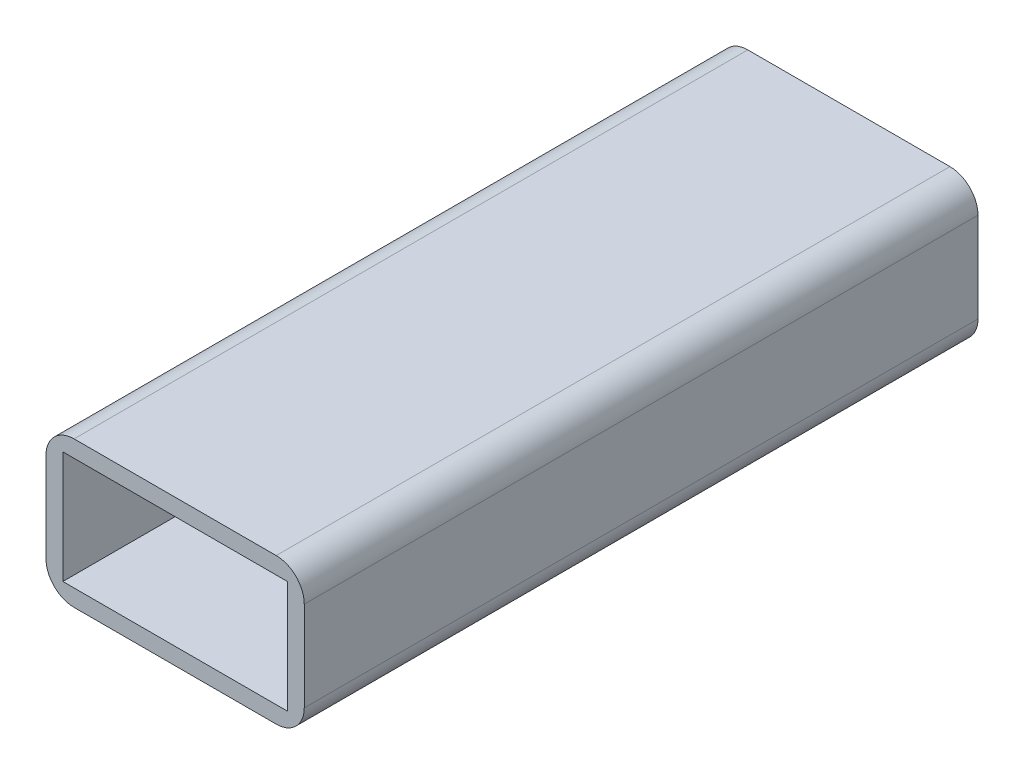
ISO-10303-21;
HEADER;
FILE_DESCRIPTION(('STEP AP214'),'2;1');
FILE_NAME('part.step','',(''),(''),'','','');
FILE_SCHEMA(('AUTOMOTIVE_DESIGN { 1 0 10303 214 1 1 1 1 }'));
ENDSEC;
DATA;
#1=APPLICATION_CONTEXT('core data for automotive mechanical design processes');
#2=APPLICATION_PROTOCOL_DEFINITION('international standard','automotive_design',2000,#1);
#3=PRODUCT_CONTEXT('',#1,'mechanical');
#4=PRODUCT('Part','Part','',(#3));
#5=PRODUCT_RELATED_PRODUCT_CATEGORY('part','',(#4));
#6=PRODUCT_DEFINITION_FORMATION('','',#4);
#7=PRODUCT_DEFINITION_CONTEXT('part definition',#1,'design');
#8=PRODUCT_DEFINITION('design','',#6,#7);
#9=PRODUCT_DEFINITION_SHAPE('','',#8);
#10=(LENGTH_UNIT() NAMED_UNIT(*) SI_UNIT(.MILLI.,.METRE.));
#11=(NAMED_UNIT(*) PLANE_ANGLE_UNIT() SI_UNIT($,.RADIAN.));
#12=(NAMED_UNIT(*) SI_UNIT($,.STERADIAN.) SOLID_ANGLE_UNIT());
#13=UNCERTAINTY_MEASURE_WITH_UNIT(LENGTH_MEASURE(1.E-05),#10,'distance_accuracy_value','');
#14=(GEOMETRIC_REPRESENTATION_CONTEXT(3) GLOBAL_UNCERTAINTY_ASSIGNED_CONTEXT((#13)) GLOBAL_UNIT_ASSIGNED_CONTEXT((#10,
#11,#12)) REPRESENTATION_CONTEXT('',''));
#15=CARTESIAN_POINT('',(0.,0.,0.));
#16=DIRECTION('',(0.,0.,1.));
#17=DIRECTION('',(1.,0.,0.));
#18=AXIS2_PLACEMENT_3D('',#15,#16,#17);
#19=CARTESIAN_POINT('',(0.,0.,120.));
#20=DIRECTION('',(0.,0.,1.));
#21=DIRECTION('',(1.,0.,0.));
#22=AXIS2_PLACEMENT_3D('',#19,#20,#21);
#23=PLANE('',#22);
#24=DIRECTION('',(0.,-1.,0.));
#25=VECTOR('',#24,1.);
#26=CARTESIAN_POINT('',(-23.,-10.,120.));
#27=LINE('',#26,#25);
#28=CARTESIAN_POINT('',(-23.,8.,120.));
#29=VERTEX_POINT('',#28);
#30=CARTESIAN_POINT('',(-23.,-8.,120.));
#31=VERTEX_POINT('',#30);
#32=EDGE_CURVE('E207',#29,#31,#27,.T.);
#33=ORIENTED_EDGE('',*,*,#32,.T.);
#34=CARTESIAN_POINT('',(-18.,-8.,120.));
#35=DIRECTION('',(0.,0.,1.));
#36=DIRECTION('',(1.,0.,0.));
#37=AXIS2_PLACEMENT_3D('',#34,#35,#36);
#38=CIRCLE('',#37,5.);
#39=CARTESIAN_POINT('',(-18.,-13.,120.));
#40=VERTEX_POINT('',#39);
#41=EDGE_CURVE('E269',#31,#40,#38,.T.);
#42=ORIENTED_EDGE('',*,*,#41,.T.);
#43=DIRECTION('',(1.,0.,0.));
#44=VECTOR('',#43,1.);
#45=CARTESIAN_POINT('',(20.,-13.,120.));
#46=LINE('',#45,#44);
#47=CARTESIAN_POINT('',(18.,-13.,120.));
#48=VERTEX_POINT('',#47);
#49=EDGE_CURVE('E211',#40,#48,#46,.T.);
#50=ORIENTED_EDGE('',*,*,#49,.T.);
#51=CARTESIAN_POINT('',(18.,-8.,120.));
#52=DIRECTION('',(0.,0.,1.));
#53=DIRECTION('',(1.,0.,0.));
#54=AXIS2_PLACEMENT_3D('',#51,#52,#53);
#55=CIRCLE('',#54,5.);
#56=CARTESIAN_POINT('',(23.,-8.,120.));
#57=VERTEX_POINT('',#56);
#58=EDGE_CURVE('E266',#48,#57,#55,.T.);
#59=ORIENTED_EDGE('',*,*,#58,.T.);
#60=DIRECTION('',(0.,1.,0.));
#61=VECTOR('',#60,1.);
#62=CARTESIAN_POINT('',(23.,-10.,120.));
#63=LINE('',#62,#61);
#64=CARTESIAN_POINT('',(23.,8.,120.));
#65=VERTEX_POINT('',#64);
#66=EDGE_CURVE('E216',#57,#65,#63,.T.);
#67=ORIENTED_EDGE('',*,*,#66,.T.);
#68=CARTESIAN_POINT('',(18.,8.,120.));
#69=DIRECTION('',(0.,0.,1.));
#70=DIRECTION('',(1.,0.,0.));
#71=AXIS2_PLACEMENT_3D('',#68,#69,#70);
#72=CIRCLE('',#71,5.);
#73=CARTESIAN_POINT('',(18.,13.,120.));
#74=VERTEX_POINT('',#73);
#75=EDGE_CURVE('E84',#65,#74,#72,.T.);
#76=ORIENTED_EDGE('',*,*,#75,.T.);
#77=DIRECTION('',(-1.,0.,0.));
#78=VECTOR('',#77,1.);
#79=CARTESIAN_POINT('',(20.,13.,120.));
#80=LINE('',#79,#78);
#81=CARTESIAN_POINT('',(-18.,13.,120.));
#82=VERTEX_POINT('',#81);
#83=EDGE_CURVE('E219',#74,#82,#80,.T.);
#84=ORIENTED_EDGE('',*,*,#83,.T.);
#85=CARTESIAN_POINT('',(-18.,8.,120.));
#86=DIRECTION('',(0.,0.,1.));
#87=DIRECTION('',(1.,0.,0.));
#88=AXIS2_PLACEMENT_3D('',#85,#86,#87);
#89=CIRCLE('',#88,5.);
#90=EDGE_CURVE('E261',#82,#29,#89,.T.);
#91=ORIENTED_EDGE('',*,*,#90,.T.);
#92=EDGE_LOOP('',(#33,#42,#50,#59,#67,#76,#84,#91));
#93=FACE_BOUND('',#92,.T.);
#94=DIRECTION('',(1.,0.,0.));
#95=VECTOR('',#94,1.);
#96=CARTESIAN_POINT('',(20.,-10.,120.));
#97=LINE('',#96,#95);
#98=CARTESIAN_POINT('',(-20.,-10.,120.));
#99=VERTEX_POINT('',#98);
#100=CARTESIAN_POINT('',(20.,-10.,120.));
#101=VERTEX_POINT('',#100);
#102=EDGE_CURVE('E165',#99,#101,#97,.T.);
#103=ORIENTED_EDGE('',*,*,#102,.F.);
#104=DIRECTION('',(0.,-1.,0.));
#105=VECTOR('',#104,1.);
#106=CARTESIAN_POINT('',(-20.,-10.,120.));
#107=LINE('',#106,#105);
#108=CARTESIAN_POINT('',(-20.,10.,120.));
#109=VERTEX_POINT('',#108);
#110=EDGE_CURVE('E154',#109,#99,#107,.T.);
#111=ORIENTED_EDGE('',*,*,#110,.F.);
#112=DIRECTION('',(-1.,0.,0.));
#113=VECTOR('',#112,1.);
#114=CARTESIAN_POINT('',(20.,10.,120.));
#115=LINE('',#114,#113);
#116=CARTESIAN_POINT('',(20.,10.,120.));
#117=VERTEX_POINT('',#116);
#118=EDGE_CURVE('E183',#117,#109,#115,.T.);
#119=ORIENTED_EDGE('',*,*,#118,.F.);
#120=DIRECTION('',(0.,1.,0.));
#121=VECTOR('',#120,1.);
#122=CARTESIAN_POINT('',(20.,-10.,120.));
#123=LINE('',#122,#121);
#124=EDGE_CURVE('E179',#101,#117,#123,.T.);
#125=ORIENTED_EDGE('',*,*,#124,.F.);
#126=EDGE_LOOP('',(#103,#111,#119,#125));
#127=FACE_BOUND('',#126,.T.);
#128=ADVANCED_FACE('F62',(#93,#127),#23,.T.);
#129=CARTESIAN_POINT('',(0.,0.,0.));
#130=DIRECTION('',(0.,0.,1.));
#131=DIRECTION('',(1.,0.,0.));
#132=AXIS2_PLACEMENT_3D('',#129,#130,#131);
#133=PLANE('',#132);
#134=DIRECTION('',(1.,0.,0.));
#135=VECTOR('',#134,1.);
#136=CARTESIAN_POINT('',(20.,-13.,0.));
#137=LINE('',#136,#135);
#138=CARTESIAN_POINT('',(-18.,-13.,0.));
#139=VERTEX_POINT('',#138);
#140=CARTESIAN_POINT('',(18.,-13.,0.));
#141=VERTEX_POINT('',#140);
#142=EDGE_CURVE('E226',#139,#141,#137,.T.);
#143=ORIENTED_EDGE('',*,*,#142,.F.);
#144=CARTESIAN_POINT('',(-18.,-8.,0.));
#145=DIRECTION('',(0.,0.,1.));
#146=DIRECTION('',(1.,0.,0.));
#147=AXIS2_PLACEMENT_3D('',#144,#145,#146);
#148=CIRCLE('',#147,5.);
#149=CARTESIAN_POINT('',(-23.,-8.,0.));
#150=VERTEX_POINT('',#149);
#151=EDGE_CURVE('E251',#139,#150,#148,.F.);
#152=ORIENTED_EDGE('',*,*,#151,.T.);
#153=DIRECTION('',(0.,-1.,0.));
#154=VECTOR('',#153,1.);
#155=CARTESIAN_POINT('',(-23.,-10.,0.));
#156=LINE('',#155,#154);
#157=CARTESIAN_POINT('',(-23.,8.,0.));
#158=VERTEX_POINT('',#157);
#159=EDGE_CURVE('E174',#158,#150,#156,.T.);
#160=ORIENTED_EDGE('',*,*,#159,.F.);
#161=CARTESIAN_POINT('',(-18.,8.,0.));
#162=DIRECTION('',(0.,0.,1.));
#163=DIRECTION('',(1.,0.,0.));
#164=AXIS2_PLACEMENT_3D('',#161,#162,#163);
#165=CIRCLE('',#164,5.);
#166=CARTESIAN_POINT('',(-18.,13.,0.));
#167=VERTEX_POINT('',#166);
#168=EDGE_CURVE('E242',#158,#167,#165,.F.);
#169=ORIENTED_EDGE('',*,*,#168,.T.);
#170=DIRECTION('',(-1.,0.,0.));
#171=VECTOR('',#170,1.);
#172=CARTESIAN_POINT('',(20.,13.,0.));
#173=LINE('',#172,#171);
#174=CARTESIAN_POINT('',(18.,13.,0.));
#175=VERTEX_POINT('',#174);
#176=EDGE_CURVE('E212',#175,#167,#173,.T.);
#177=ORIENTED_EDGE('',*,*,#176,.F.);
#178=CARTESIAN_POINT('',(18.,8.,0.));
#179=DIRECTION('',(0.,0.,1.));
#180=DIRECTION('',(1.,0.,0.));
#181=AXIS2_PLACEMENT_3D('',#178,#179,#180);
#182=CIRCLE('',#181,5.);
#183=CARTESIAN_POINT('',(23.,8.,0.));
#184=VERTEX_POINT('',#183);
#185=EDGE_CURVE('E245',#175,#184,#182,.F.);
#186=ORIENTED_EDGE('',*,*,#185,.T.);
#187=DIRECTION('',(0.,1.,0.));
#188=VECTOR('',#187,1.);
#189=CARTESIAN_POINT('',(23.,-10.,0.));
#190=LINE('',#189,#188);
#191=CARTESIAN_POINT('',(23.,-8.,0.));
#192=VERTEX_POINT('',#191);
#193=EDGE_CURVE('E230',#192,#184,#190,.T.);
#194=ORIENTED_EDGE('',*,*,#193,.F.);
#195=CARTESIAN_POINT('',(18.,-8.,0.));
#196=DIRECTION('',(0.,0.,1.));
#197=DIRECTION('',(1.,0.,0.));
#198=AXIS2_PLACEMENT_3D('',#195,#196,#197);
#199=CIRCLE('',#198,5.);
#200=EDGE_CURVE('E248',#192,#141,#199,.F.);
#201=ORIENTED_EDGE('',*,*,#200,.T.);
#202=EDGE_LOOP('',(#143,#152,#160,#169,#177,#186,#194,#201));
#203=FACE_BOUND('',#202,.T.);
#204=DIRECTION('',(0.,-1.,0.));
#205=VECTOR('',#204,1.);
#206=CARTESIAN_POINT('',(-20.,-10.,0.));
#207=LINE('',#206,#205);
#208=CARTESIAN_POINT('',(-20.,10.,0.));
#209=VERTEX_POINT('',#208);
#210=CARTESIAN_POINT('',(-20.,-10.,0.));
#211=VERTEX_POINT('',#210);
#212=EDGE_CURVE('E188',#209,#211,#207,.T.);
#213=ORIENTED_EDGE('',*,*,#212,.T.);
#214=DIRECTION('',(1.,0.,0.));
#215=VECTOR('',#214,1.);
#216=CARTESIAN_POINT('',(20.,-10.,0.));
#217=LINE('',#216,#215);
#218=CARTESIAN_POINT('',(20.,-10.,0.));
#219=VERTEX_POINT('',#218);
#220=EDGE_CURVE('E172',#211,#219,#217,.T.);
#221=ORIENTED_EDGE('',*,*,#220,.T.);
#222=DIRECTION('',(0.,1.,0.));
#223=VECTOR('',#222,1.);
#224=CARTESIAN_POINT('',(20.,-10.,0.));
#225=LINE('',#224,#223);
#226=CARTESIAN_POINT('',(20.,10.,0.));
#227=VERTEX_POINT('',#226);
#228=EDGE_CURVE('E193',#219,#227,#225,.T.);
#229=ORIENTED_EDGE('',*,*,#228,.T.);
#230=DIRECTION('',(-1.,0.,0.));
#231=VECTOR('',#230,1.);
#232=CARTESIAN_POINT('',(20.,10.,0.));
#233=LINE('',#232,#231);
#234=EDGE_CURVE('E166',#227,#209,#233,.T.);
#235=ORIENTED_EDGE('',*,*,#234,.T.);
#236=EDGE_LOOP('',(#213,#221,#229,#235));
#237=FACE_BOUND('',#236,.T.);
#238=ADVANCED_FACE('F289',(#203,#237),#133,.F.);
#239=CARTESIAN_POINT('',(-23.,-10.,120.));
#240=DIRECTION('',(1.,0.,0.));
#241=DIRECTION('',(0.,0.,-1.));
#242=AXIS2_PLACEMENT_3D('',#239,#240,#241);
#243=PLANE('',#242);
#244=ORIENTED_EDGE('',*,*,#159,.T.);
#245=DIRECTION('',(0.,0.,-1.));
#246=VECTOR('',#245,1.);
#247=CARTESIAN_POINT('',(-23.,-8.,120.));
#248=LINE('',#247,#246);
#249=EDGE_CURVE('E258',#150,#31,#248,.F.);
#250=ORIENTED_EDGE('',*,*,#249,.T.);
#251=ORIENTED_EDGE('',*,*,#32,.F.);
#252=DIRECTION('',(0.,0.,-1.));
#253=VECTOR('',#252,1.);
#254=CARTESIAN_POINT('',(-23.,8.,120.));
#255=LINE('',#254,#253);
#256=EDGE_CURVE('E254',#29,#158,#255,.T.);
#257=ORIENTED_EDGE('',*,*,#256,.T.);
#258=EDGE_LOOP('',(#244,#250,#251,#257));
#259=FACE_BOUND('',#258,.T.);
#260=ADVANCED_FACE('F302',(#259),#243,.F.);
#261=CARTESIAN_POINT('',(20.,-13.,120.));
#262=DIRECTION('',(0.,1.,0.));
#263=DIRECTION('',(-1.,0.,0.));
#264=AXIS2_PLACEMENT_3D('',#261,#262,#263);
#265=PLANE('',#264);
#266=ORIENTED_EDGE('',*,*,#49,.F.);
#267=DIRECTION('',(0.,0.,-1.));
#268=VECTOR('',#267,1.);
#269=CARTESIAN_POINT('',(-18.,-13.,120.));
#270=LINE('',#269,#268);
#271=EDGE_CURVE('E238',#40,#139,#270,.T.);
#272=ORIENTED_EDGE('',*,*,#271,.T.);
#273=ORIENTED_EDGE('',*,*,#142,.T.);
#274=DIRECTION('',(0.,0.,-1.));
#275=VECTOR('',#274,1.);
#276=CARTESIAN_POINT('',(18.,-13.,120.));
#277=LINE('',#276,#275);
#278=EDGE_CURVE('E222',#141,#48,#277,.F.);
#279=ORIENTED_EDGE('',*,*,#278,.T.);
#280=EDGE_LOOP('',(#266,#272,#273,#279));
#281=FACE_BOUND('',#280,.T.);
#282=ADVANCED_FACE('F310',(#281),#265,.F.);
#283=CARTESIAN_POINT('',(23.,-10.,120.));
#284=DIRECTION('',(-1.,0.,0.));
#285=DIRECTION('',(0.,0.,1.));
#286=AXIS2_PLACEMENT_3D('',#283,#284,#285);
#287=PLANE('',#286);
#288=ORIENTED_EDGE('',*,*,#66,.F.);
#289=DIRECTION('',(0.,0.,-1.));
#290=VECTOR('',#289,1.);
#291=CARTESIAN_POINT('',(23.,-8.,120.));
#292=LINE('',#291,#290);
#293=EDGE_CURVE('E275',#57,#192,#292,.T.);
#294=ORIENTED_EDGE('',*,*,#293,.T.);
#295=ORIENTED_EDGE('',*,*,#193,.T.);
#296=DIRECTION('',(0.,0.,-1.));
#297=VECTOR('',#296,1.);
#298=CARTESIAN_POINT('',(23.,8.,120.));
#299=LINE('',#298,#297);
#300=EDGE_CURVE('E272',#184,#65,#299,.F.);
#301=ORIENTED_EDGE('',*,*,#300,.T.);
#302=EDGE_LOOP('',(#288,#294,#295,#301));
#303=FACE_BOUND('',#302,.T.);
#304=ADVANCED_FACE('F283',(#303),#287,.F.);
#305=CARTESIAN_POINT('',(20.,13.,120.));
#306=DIRECTION('',(0.,-1.,0.));
#307=DIRECTION('',(0.,0.,-1.));
#308=AXIS2_PLACEMENT_3D('',#305,#306,#307);
#309=PLANE('',#308);
#310=ORIENTED_EDGE('',*,*,#83,.F.);
#311=DIRECTION('',(0.,0.,-1.));
#312=VECTOR('',#311,1.);
#313=CARTESIAN_POINT('',(18.,13.,120.));
#314=LINE('',#313,#312);
#315=EDGE_CURVE('E12',#74,#175,#314,.T.);
#316=ORIENTED_EDGE('',*,*,#315,.T.);
#317=ORIENTED_EDGE('',*,*,#176,.T.);
#318=DIRECTION('',(0.,0.,-1.));
#319=VECTOR('',#318,1.);
#320=CARTESIAN_POINT('',(-18.,13.,120.));
#321=LINE('',#320,#319);
#322=EDGE_CURVE('E71',#167,#82,#321,.F.);
#323=ORIENTED_EDGE('',*,*,#322,.T.);
#324=EDGE_LOOP('',(#310,#316,#317,#323));
#325=FACE_BOUND('',#324,.T.);
#326=ADVANCED_FACE('F295',(#325),#309,.F.);
#327=CARTESIAN_POINT('',(-20.,-10.,120.));
#328=DIRECTION('',(1.,0.,0.));
#329=DIRECTION('',(0.,0.,-1.));
#330=AXIS2_PLACEMENT_3D('',#327,#328,#329);
#331=PLANE('',#330);
#332=ORIENTED_EDGE('',*,*,#212,.F.);
#333=DIRECTION('',(0.,0.,-1.));
#334=VECTOR('',#333,1.);
#335=CARTESIAN_POINT('',(-20.,10.,120.));
#336=LINE('',#335,#334);
#337=EDGE_CURVE('E160',#109,#209,#336,.T.);
#338=ORIENTED_EDGE('',*,*,#337,.F.);
#339=ORIENTED_EDGE('',*,*,#110,.T.);
#340=DIRECTION('',(0.,0.,-1.));
#341=VECTOR('',#340,1.);
#342=CARTESIAN_POINT('',(-20.,-10.,120.));
#343=LINE('',#342,#341);
#344=EDGE_CURVE('E157',#99,#211,#343,.T.);
#345=ORIENTED_EDGE('',*,*,#344,.T.);
#346=EDGE_LOOP('',(#332,#338,#339,#345));
#347=FACE_BOUND('',#346,.T.);
#348=ADVANCED_FACE('F156',(#347),#331,.T.);
#349=CARTESIAN_POINT('',(20.,-10.,120.));
#350=DIRECTION('',(0.,1.,0.));
#351=DIRECTION('',(-1.,0.,0.));
#352=AXIS2_PLACEMENT_3D('',#349,#350,#351);
#353=PLANE('',#352);
#354=ORIENTED_EDGE('',*,*,#220,.F.);
#355=ORIENTED_EDGE('',*,*,#344,.F.);
#356=ORIENTED_EDGE('',*,*,#102,.T.);
#357=DIRECTION('',(0.,0.,-1.));
#358=VECTOR('',#357,1.);
#359=CARTESIAN_POINT('',(20.,-10.,120.));
#360=LINE('',#359,#358);
#361=EDGE_CURVE('E175',#101,#219,#360,.T.);
#362=ORIENTED_EDGE('',*,*,#361,.T.);
#363=EDGE_LOOP('',(#354,#355,#356,#362));
#364=FACE_BOUND('',#363,.T.);
#365=ADVANCED_FACE('F169',(#364),#353,.T.);
#366=CARTESIAN_POINT('',(20.,-10.,120.));
#367=DIRECTION('',(-1.,0.,0.));
#368=DIRECTION('',(0.,0.,1.));
#369=AXIS2_PLACEMENT_3D('',#366,#367,#368);
#370=PLANE('',#369);
#371=ORIENTED_EDGE('',*,*,#228,.F.);
#372=ORIENTED_EDGE('',*,*,#361,.F.);
#373=ORIENTED_EDGE('',*,*,#124,.T.);
#374=DIRECTION('',(0.,0.,-1.));
#375=VECTOR('',#374,1.);
#376=CARTESIAN_POINT('',(20.,10.,120.));
#377=LINE('',#376,#375);
#378=EDGE_CURVE('E202',#117,#227,#377,.T.);
#379=ORIENTED_EDGE('',*,*,#378,.T.);
#380=EDGE_LOOP('',(#371,#372,#373,#379));
#381=FACE_BOUND('',#380,.T.);
#382=ADVANCED_FACE('F365',(#381),#370,.T.);
#383=CARTESIAN_POINT('',(20.,10.,120.));
#384=DIRECTION('',(0.,-1.,0.));
#385=DIRECTION('',(0.,0.,-1.));
#386=AXIS2_PLACEMENT_3D('',#383,#384,#385);
#387=PLANE('',#386);
#388=ORIENTED_EDGE('',*,*,#234,.F.);
#389=ORIENTED_EDGE('',*,*,#378,.F.);
#390=ORIENTED_EDGE('',*,*,#118,.T.);
#391=ORIENTED_EDGE('',*,*,#337,.T.);
#392=EDGE_LOOP('',(#388,#389,#390,#391));
#393=FACE_BOUND('',#392,.T.);
#394=ADVANCED_FACE('F319',(#393),#387,.T.);
#395=CARTESIAN_POINT('',(-18.,-8.,120.));
#396=DIRECTION('',(0.,0.,-1.));
#397=DIRECTION('',(-1.,0.,0.));
#398=AXIS2_PLACEMENT_3D('',#395,#396,#397);
#399=CYLINDRICAL_SURFACE('',#398,5.);
#400=ORIENTED_EDGE('',*,*,#41,.F.);
#401=ORIENTED_EDGE('',*,*,#249,.F.);
#402=ORIENTED_EDGE('',*,*,#151,.F.);
#403=ORIENTED_EDGE('',*,*,#271,.F.);
#404=EDGE_LOOP('',(#400,#401,#402,#403));
#405=FACE_BOUND('',#404,.T.);
#406=ADVANCED_FACE('F307',(#405),#399,.T.);
#407=CARTESIAN_POINT('',(18.,-8.,120.));
#408=DIRECTION('',(0.,0.,-1.));
#409=DIRECTION('',(-1.,0.,0.));
#410=AXIS2_PLACEMENT_3D('',#407,#408,#409);
#411=CYLINDRICAL_SURFACE('',#410,5.);
#412=ORIENTED_EDGE('',*,*,#58,.F.);
#413=ORIENTED_EDGE('',*,*,#278,.F.);
#414=ORIENTED_EDGE('',*,*,#200,.F.);
#415=ORIENTED_EDGE('',*,*,#293,.F.);
#416=EDGE_LOOP('',(#412,#413,#414,#415));
#417=FACE_BOUND('',#416,.T.);
#418=ADVANCED_FACE('F312',(#417),#411,.T.);
#419=CARTESIAN_POINT('',(18.,8.,120.));
#420=DIRECTION('',(0.,0.,-1.));
#421=DIRECTION('',(-1.,0.,0.));
#422=AXIS2_PLACEMENT_3D('',#419,#420,#421);
#423=CYLINDRICAL_SURFACE('',#422,5.);
#424=ORIENTED_EDGE('',*,*,#75,.F.);
#425=ORIENTED_EDGE('',*,*,#300,.F.);
#426=ORIENTED_EDGE('',*,*,#185,.F.);
#427=ORIENTED_EDGE('',*,*,#315,.F.);
#428=EDGE_LOOP('',(#424,#425,#426,#427));
#429=FACE_BOUND('',#428,.T.);
#430=ADVANCED_FACE('F294',(#429),#423,.T.);
#431=CARTESIAN_POINT('',(-18.,8.,120.));
#432=DIRECTION('',(0.,0.,-1.));
#433=DIRECTION('',(-1.,0.,0.));
#434=AXIS2_PLACEMENT_3D('',#431,#432,#433);
#435=CYLINDRICAL_SURFACE('',#434,5.);
#436=ORIENTED_EDGE('',*,*,#90,.F.);
#437=ORIENTED_EDGE('',*,*,#322,.F.);
#438=ORIENTED_EDGE('',*,*,#168,.F.);
#439=ORIENTED_EDGE('',*,*,#256,.F.);
#440=EDGE_LOOP('',(#436,#437,#438,#439));
#441=FACE_BOUND('',#440,.T.);
#442=ADVANCED_FACE('F64',(#441),#435,.T.);
#443=CLOSED_SHELL('',(#128,#238,#260,#282,#304,#326,#348,#365,#382,#394,#406,#418,#430,#442));
#444=MANIFOLD_SOLID_BREP('B2',#443);
#445=ADVANCED_BREP_SHAPE_REPRESENTATION('',(#18,#444),#14);
#446=SHAPE_DEFINITION_REPRESENTATION(#9,#445);
ENDSEC;
END-ISO-10303-21;
